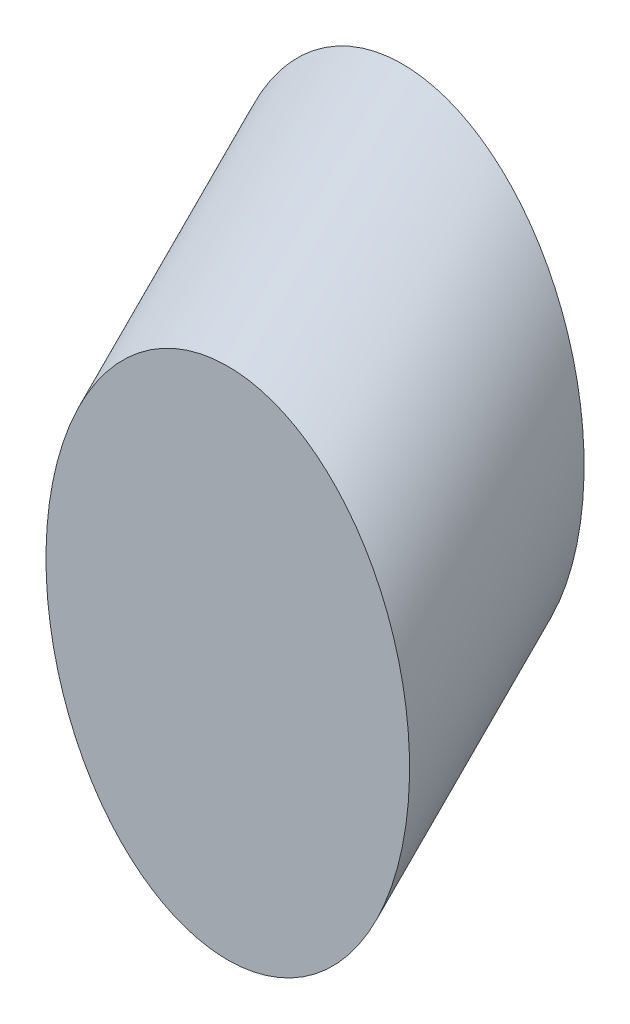
ISO-10303-21;
HEADER;
FILE_DESCRIPTION(('STEP AP214'),'2;1');
FILE_NAME('part.step','',(''),(''),'','','');
FILE_SCHEMA(('AUTOMOTIVE_DESIGN { 1 0 10303 214 1 1 1 1 }'));
ENDSEC;
DATA;
#1=APPLICATION_CONTEXT('core data for automotive mechanical design processes');
#2=APPLICATION_PROTOCOL_DEFINITION('international standard','automotive_design',2000,#1);
#3=PRODUCT_CONTEXT('',#1,'mechanical');
#4=PRODUCT('Part','Part','',(#3));
#5=PRODUCT_RELATED_PRODUCT_CATEGORY('part','',(#4));
#6=PRODUCT_DEFINITION_FORMATION('','',#4);
#7=PRODUCT_DEFINITION_CONTEXT('part definition',#1,'design');
#8=PRODUCT_DEFINITION('design','',#6,#7);
#9=PRODUCT_DEFINITION_SHAPE('','',#8);
#10=(LENGTH_UNIT() NAMED_UNIT(*) SI_UNIT(.MILLI.,.METRE.));
#11=(NAMED_UNIT(*) PLANE_ANGLE_UNIT() SI_UNIT($,.RADIAN.));
#12=(NAMED_UNIT(*) SI_UNIT($,.STERADIAN.) SOLID_ANGLE_UNIT());
#13=UNCERTAINTY_MEASURE_WITH_UNIT(LENGTH_MEASURE(1.E-05),#10,'distance_accuracy_value','');
#14=(GEOMETRIC_REPRESENTATION_CONTEXT(3) GLOBAL_UNCERTAINTY_ASSIGNED_CONTEXT((#13)) GLOBAL_UNIT_ASSIGNED_CONTEXT((#10,
#11,#12)) REPRESENTATION_CONTEXT('',''));
#15=CARTESIAN_POINT('',(0.,0.,0.));
#16=DIRECTION('',(0.,0.,1.));
#17=DIRECTION('',(1.,0.,0.));
#18=AXIS2_PLACEMENT_3D('',#15,#16,#17);
#19=CARTESIAN_POINT('',(54.3923829817161,41.7888847007243,-6.0000131704022));
#20=DIRECTION('',(0.,0.,1.));
#21=DIRECTION('',(0.,-1.,0.));
#22=AXIS2_PLACEMENT_3D('',#19,#20,#21);
#23=ELLIPSE('',#22,8.84,6.25);
#24=DIRECTION('',(0.,-0.707106781186548,0.707106781186547));
#25=VECTOR('',#24,1.);
#26=SURFACE_OF_LINEAR_EXTRUSION('',#23,#25);
#27=CARTESIAN_POINT('',(54.3923829817161,32.9488847007243,-6.0000131704022));
#28=VERTEX_POINT('',#27);
#29=EDGE_CURVE('E10',#28,#28,#23,.T.);
#30=ORIENTED_EDGE('',*,*,#29,.T.);
#31=EDGE_LOOP('',(#30));
#32=FACE_BOUND('',#31,.T.);
#33=CARTESIAN_POINT('',(54.3923829817161,35.7888715303221,0.));
#34=DIRECTION('',(0.,0.,1.));
#35=DIRECTION('',(0.,-1.,0.));
#36=AXIS2_PLACEMENT_3D('',#33,#34,#35);
#37=ELLIPSE('',#36,8.84,6.25);
#38=CARTESIAN_POINT('',(54.3923829817161,26.9488715303221,0.));
#39=VERTEX_POINT('',#38);
#40=EDGE_CURVE('E39',#39,#39,#37,.T.);
#41=ORIENTED_EDGE('',*,*,#40,.F.);
#42=EDGE_LOOP('',(#41));
#43=FACE_BOUND('',#42,.T.);
#44=ADVANCED_FACE('F35',(#32,#43),#26,.T.);
#45=CARTESIAN_POINT('',(54.3923829817161,41.7888847007243,-6.0000131704022));
#46=DIRECTION('',(0.,0.,1.));
#47=DIRECTION('',(1.,0.,0.));
#48=AXIS2_PLACEMENT_3D('',#45,#46,#47);
#49=PLANE('',#48);
#50=ORIENTED_EDGE('',*,*,#29,.F.);
#51=EDGE_LOOP('',(#50));
#52=FACE_BOUND('',#51,.T.);
#53=ADVANCED_FACE('F51',(#52),#49,.F.);
#54=CARTESIAN_POINT('',(54.3923829817161,35.7888715303221,0.));
#55=DIRECTION('',(0.,0.,1.));
#56=DIRECTION('',(1.,0.,0.));
#57=AXIS2_PLACEMENT_3D('',#54,#55,#56);
#58=PLANE('',#57);
#59=ORIENTED_EDGE('',*,*,#40,.T.);
#60=EDGE_LOOP('',(#59));
#61=FACE_BOUND('',#60,.T.);
#62=ADVANCED_FACE('F48',(#61),#58,.T.);
#63=CLOSED_SHELL('',(#44,#53,#62));
#64=MANIFOLD_SOLID_BREP('B2',#63);
#65=ADVANCED_BREP_SHAPE_REPRESENTATION('',(#18,#64),#14);
#66=SHAPE_DEFINITION_REPRESENTATION(#9,#65);
ENDSEC;
END-ISO-10303-21;
